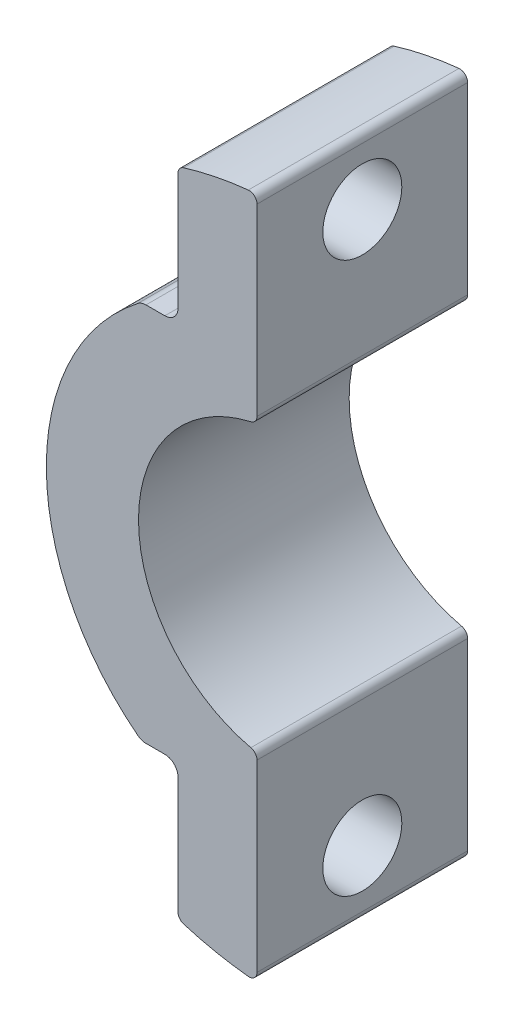
ISO-10303-21;
HEADER;
FILE_DESCRIPTION(('STEP AP214'),'2;1');
FILE_NAME('part.step','',(''),(''),'','','');
FILE_SCHEMA(('AUTOMOTIVE_DESIGN { 1 0 10303 214 1 1 1 1 }'));
ENDSEC;
DATA;
#1=APPLICATION_CONTEXT('core data for automotive mechanical design processes');
#2=APPLICATION_PROTOCOL_DEFINITION('international standard','automotive_design',2000,#1);
#3=PRODUCT_CONTEXT('',#1,'mechanical');
#4=PRODUCT('Part','Part','',(#3));
#5=PRODUCT_RELATED_PRODUCT_CATEGORY('part','',(#4));
#6=PRODUCT_DEFINITION_FORMATION('','',#4);
#7=PRODUCT_DEFINITION_CONTEXT('part definition',#1,'design');
#8=PRODUCT_DEFINITION('design','',#6,#7);
#9=PRODUCT_DEFINITION_SHAPE('','',#8);
#10=(LENGTH_UNIT() NAMED_UNIT(*) SI_UNIT(.MILLI.,.METRE.));
#11=(NAMED_UNIT(*) PLANE_ANGLE_UNIT() SI_UNIT($,.RADIAN.));
#12=(NAMED_UNIT(*) SI_UNIT($,.STERADIAN.) SOLID_ANGLE_UNIT());
#13=UNCERTAINTY_MEASURE_WITH_UNIT(LENGTH_MEASURE(1.E-05),#10,'distance_accuracy_value','');
#14=(GEOMETRIC_REPRESENTATION_CONTEXT(3) GLOBAL_UNCERTAINTY_ASSIGNED_CONTEXT((#13)) GLOBAL_UNIT_ASSIGNED_CONTEXT((#10,
#11,#12)) REPRESENTATION_CONTEXT('',''));
#15=CARTESIAN_POINT('',(0.,0.,0.));
#16=DIRECTION('',(0.,0.,1.));
#17=DIRECTION('',(1.,0.,0.));
#18=AXIS2_PLACEMENT_3D('',#15,#16,#17);
#19=CARTESIAN_POINT('',(0.,0.,8.));
#20=DIRECTION('',(0.,0.,1.));
#21=DIRECTION('',(1.,0.,0.));
#22=AXIS2_PLACEMENT_3D('',#19,#20,#21);
#23=PLANE('',#22);
#24=CARTESIAN_POINT('',(0.,0.,8.));
#25=DIRECTION('',(0.,0.,-1.));
#26=DIRECTION('',(1.,0.,0.));
#27=AXIS2_PLACEMENT_3D('',#24,#25,#26);
#28=CIRCLE('',#27,9.);
#29=CARTESIAN_POINT('',(-5.52275871873927,-7.10627442015782,8.));
#30=VERTEX_POINT('',#29);
#31=CARTESIAN_POINT('',(-5.52275871873927,7.10627442015782,8.));
#32=VERTEX_POINT('',#31);
#33=EDGE_CURVE('E319',#30,#32,#28,.T.);
#34=ORIENTED_EDGE('',*,*,#33,.F.);
#35=CARTESIAN_POINT('',(-5.21593878992042,-6.71148139681572,8.));
#36=DIRECTION('',(0.,0.,1.));
#37=DIRECTION('',(1.,0.,0.));
#38=AXIS2_PLACEMENT_3D('',#35,#36,#37);
#39=CIRCLE('',#38,0.5);
#40=CARTESIAN_POINT('',(-5.21593878992042,-7.21148139681572,8.));
#41=VERTEX_POINT('',#40);
#42=EDGE_CURVE('E43',#30,#41,#39,.T.);
#43=ORIENTED_EDGE('',*,*,#42,.T.);
#44=DIRECTION('',(-1.,0.,0.));
#45=VECTOR('',#44,1.);
#46=CARTESIAN_POINT('',(-4.,-7.21148139681572,8.));
#47=LINE('',#46,#45);
#48=CARTESIAN_POINT('',(-4.5,-7.21148139681572,8.));
#49=VERTEX_POINT('',#48);
#50=EDGE_CURVE('E190',#49,#41,#47,.T.);
#51=ORIENTED_EDGE('',*,*,#50,.F.);
#52=CARTESIAN_POINT('',(-4.5,-7.71148139681572,8.));
#53=DIRECTION('',(0.,0.,1.));
#54=DIRECTION('',(1.,0.,0.));
#55=AXIS2_PLACEMENT_3D('',#52,#53,#54);
#56=CIRCLE('',#55,0.5);
#57=CARTESIAN_POINT('',(-4.,-7.71148139681572,8.));
#58=VERTEX_POINT('',#57);
#59=EDGE_CURVE('E173',#49,#58,#56,.F.);
#60=ORIENTED_EDGE('',*,*,#59,.T.);
#61=DIRECTION('',(0.,1.,0.));
#62=VECTOR('',#61,1.);
#63=CARTESIAN_POINT('',(-4.,-7.21148139681572,8.));
#64=LINE('',#63,#62);
#65=CARTESIAN_POINT('',(-4.,-12.14907403879,8.));
#66=VERTEX_POINT('',#65);
#67=EDGE_CURVE('E198',#66,#58,#64,.T.);
#68=ORIENTED_EDGE('',*,*,#67,.F.);
#69=CARTESIAN_POINT('',(-3.7,-12.14907403879,8.));
#70=DIRECTION('',(0.,0.,1.));
#71=DIRECTION('',(1.,0.,0.));
#72=AXIS2_PLACEMENT_3D('',#69,#70,#71);
#73=CIRCLE('',#72,0.3);
#74=CARTESIAN_POINT('',(-3.78740157480315,-12.4360600397063,8.));
#75=VERTEX_POINT('',#74);
#76=EDGE_CURVE('E281',#66,#75,#73,.T.);
#77=ORIENTED_EDGE('',*,*,#76,.T.);
#78=CARTESIAN_POINT('',(0.,0.,8.));
#79=DIRECTION('',(0.,0.,1.));
#80=DIRECTION('',(1.,0.,0.));
#81=AXIS2_PLACEMENT_3D('',#78,#79,#80);
#82=CIRCLE('',#81,13.);
#83=CARTESIAN_POINT('',(-1.33070866141732,-12.9317135159432,8.));
#84=VERTEX_POINT('',#83);
#85=EDGE_CURVE('E229',#75,#84,#82,.T.);
#86=ORIENTED_EDGE('',*,*,#85,.T.);
#87=CARTESIAN_POINT('',(-1.3,-12.633289357883,8.));
#88=DIRECTION('',(0.,0.,1.));
#89=DIRECTION('',(1.,0.,0.));
#90=AXIS2_PLACEMENT_3D('',#87,#88,#89);
#91=CIRCLE('',#90,0.3);
#92=CARTESIAN_POINT('',(-1.,-12.633289357883,8.));
#93=VERTEX_POINT('',#92);
#94=EDGE_CURVE('E279',#84,#93,#91,.T.);
#95=ORIENTED_EDGE('',*,*,#94,.T.);
#96=DIRECTION('',(0.,-1.,0.));
#97=VECTOR('',#96,1.);
#98=CARTESIAN_POINT('',(-1.,24.2431667663396,8.));
#99=LINE('',#98,#97);
#100=CARTESIAN_POINT('',(-1.,-5.65243310442503,8.));
#101=VERTEX_POINT('',#100);
#102=EDGE_CURVE('E208',#101,#93,#99,.T.);
#103=ORIENTED_EDGE('',*,*,#102,.F.);
#104=CARTESIAN_POINT('',(-1.3,-5.65243310442503,8.));
#105=DIRECTION('',(0.,0.,1.));
#106=DIRECTION('',(1.,0.,0.));
#107=AXIS2_PLACEMENT_3D('',#104,#105,#106);
#108=CIRCLE('',#107,0.3);
#109=CARTESIAN_POINT('',(-1.23275862068966,-5.36006587488581,8.));
#110=VERTEX_POINT('',#109);
#111=EDGE_CURVE('E277',#101,#110,#108,.T.);
#112=ORIENTED_EDGE('',*,*,#111,.T.);
#113=CARTESIAN_POINT('',(0.,0.,8.));
#114=DIRECTION('',(0.,0.,1.));
#115=DIRECTION('',(1.,0.,0.));
#116=AXIS2_PLACEMENT_3D('',#113,#114,#115);
#117=CIRCLE('',#116,5.5);
#118=CARTESIAN_POINT('',(-1.23275862068966,5.36006587488581,8.));
#119=VERTEX_POINT('',#118);
#120=EDGE_CURVE('E220',#119,#110,#117,.T.);
#121=ORIENTED_EDGE('',*,*,#120,.F.);
#122=CARTESIAN_POINT('',(-1.3,5.65243310442503,8.));
#123=DIRECTION('',(0.,0.,1.));
#124=DIRECTION('',(1.,0.,0.));
#125=AXIS2_PLACEMENT_3D('',#122,#123,#124);
#126=CIRCLE('',#125,0.3);
#127=CARTESIAN_POINT('',(-1.,5.65243310442503,8.));
#128=VERTEX_POINT('',#127);
#129=EDGE_CURVE('E275',#119,#128,#126,.T.);
#130=ORIENTED_EDGE('',*,*,#129,.T.);
#131=CARTESIAN_POINT('',(-1.,12.633289357883,8.));
#132=VERTEX_POINT('',#131);
#133=EDGE_CURVE('E217',#132,#128,#99,.T.);
#134=ORIENTED_EDGE('',*,*,#133,.F.);
#135=CARTESIAN_POINT('',(-1.3,12.633289357883,8.));
#136=DIRECTION('',(0.,0.,1.));
#137=DIRECTION('',(1.,0.,0.));
#138=AXIS2_PLACEMENT_3D('',#135,#136,#137);
#139=CIRCLE('',#138,0.3);
#140=CARTESIAN_POINT('',(-1.33070866141732,12.9317135159432,8.));
#141=VERTEX_POINT('',#140);
#142=EDGE_CURVE('E271',#132,#141,#139,.T.);
#143=ORIENTED_EDGE('',*,*,#142,.T.);
#144=CARTESIAN_POINT('',(-3.78740157480315,12.4360600397063,8.));
#145=VERTEX_POINT('',#144);
#146=EDGE_CURVE('E194',#141,#145,#82,.T.);
#147=ORIENTED_EDGE('',*,*,#146,.T.);
#148=CARTESIAN_POINT('',(-3.7,12.14907403879,8.));
#149=DIRECTION('',(0.,0.,1.));
#150=DIRECTION('',(1.,0.,0.));
#151=AXIS2_PLACEMENT_3D('',#148,#149,#150);
#152=CIRCLE('',#151,0.3);
#153=CARTESIAN_POINT('',(-4.,12.14907403879,8.));
#154=VERTEX_POINT('',#153);
#155=EDGE_CURVE('E273',#145,#154,#152,.T.);
#156=ORIENTED_EDGE('',*,*,#155,.T.);
#157=DIRECTION('',(0.,1.,0.));
#158=VECTOR('',#157,1.);
#159=CARTESIAN_POINT('',(-4.,21.0444914195402,8.));
#160=LINE('',#159,#158);
#161=CARTESIAN_POINT('',(-4.,7.71148139681573,8.));
#162=VERTEX_POINT('',#161);
#163=EDGE_CURVE('E327',#162,#154,#160,.T.);
#164=ORIENTED_EDGE('',*,*,#163,.F.);
#165=CARTESIAN_POINT('',(-4.5,7.71148139681572,8.));
#166=DIRECTION('',(0.,0.,1.));
#167=DIRECTION('',(1.,0.,0.));
#168=AXIS2_PLACEMENT_3D('',#165,#166,#167);
#169=CIRCLE('',#168,0.5);
#170=CARTESIAN_POINT('',(-4.5,7.21148139681572,8.));
#171=VERTEX_POINT('',#170);
#172=EDGE_CURVE('E246',#162,#171,#169,.F.);
#173=ORIENTED_EDGE('',*,*,#172,.T.);
#174=DIRECTION('',(1.,0.,0.));
#175=VECTOR('',#174,1.);
#176=CARTESIAN_POINT('',(-28.8712300204423,7.21148139681572,8.));
#177=LINE('',#176,#175);
#178=CARTESIAN_POINT('',(-5.21593878992042,7.21148139681572,8.));
#179=VERTEX_POINT('',#178);
#180=EDGE_CURVE('E326',#179,#171,#177,.T.);
#181=ORIENTED_EDGE('',*,*,#180,.F.);
#182=CARTESIAN_POINT('',(-5.21593878992042,6.71148139681572,8.));
#183=DIRECTION('',(0.,0.,1.));
#184=DIRECTION('',(1.,0.,0.));
#185=AXIS2_PLACEMENT_3D('',#182,#183,#184);
#186=CIRCLE('',#185,0.5);
#187=EDGE_CURVE('E50',#179,#32,#186,.T.);
#188=ORIENTED_EDGE('',*,*,#187,.T.);
#189=EDGE_LOOP('',(#34,#43,#51,#60,#68,#77,#86,#95,#103,#112,#121,#130,#134,#143,#147,#156,#164,
#173,#181,#188));
#190=FACE_BOUND('',#189,.T.);
#191=ADVANCED_FACE('F35',(#190),#23,.T.);
#192=CARTESIAN_POINT('',(0.,0.,0.));
#193=DIRECTION('',(0.,0.,1.));
#194=DIRECTION('',(1.,0.,0.));
#195=AXIS2_PLACEMENT_3D('',#192,#193,#194);
#196=PLANE('',#195);
#197=DIRECTION('',(-1.,0.,0.));
#198=VECTOR('',#197,1.);
#199=CARTESIAN_POINT('',(-4.,-7.21148139681572,0.));
#200=LINE('',#199,#198);
#201=CARTESIAN_POINT('',(-4.5,-7.21148139681572,0.));
#202=VERTEX_POINT('',#201);
#203=CARTESIAN_POINT('',(-5.21593878992042,-7.21148139681572,0.));
#204=VERTEX_POINT('',#203);
#205=EDGE_CURVE('E193',#202,#204,#200,.T.);
#206=ORIENTED_EDGE('',*,*,#205,.T.);
#207=CARTESIAN_POINT('',(-5.21593878992042,-6.71148139681572,0.));
#208=DIRECTION('',(0.,0.,1.));
#209=DIRECTION('',(1.,0.,0.));
#210=AXIS2_PLACEMENT_3D('',#207,#208,#209);
#211=CIRCLE('',#210,0.5);
#212=CARTESIAN_POINT('',(-5.52275871873927,-7.10627442015782,0.));
#213=VERTEX_POINT('',#212);
#214=EDGE_CURVE('E309',#204,#213,#211,.F.);
#215=ORIENTED_EDGE('',*,*,#214,.T.);
#216=CARTESIAN_POINT('',(0.,0.,0.));
#217=DIRECTION('',(0.,0.,-1.));
#218=DIRECTION('',(1.,0.,0.));
#219=AXIS2_PLACEMENT_3D('',#216,#217,#218);
#220=CIRCLE('',#219,9.);
#221=CARTESIAN_POINT('',(-5.52275871873927,7.10627442015782,0.));
#222=VERTEX_POINT('',#221);
#223=EDGE_CURVE('E201',#213,#222,#220,.T.);
#224=ORIENTED_EDGE('',*,*,#223,.T.);
#225=CARTESIAN_POINT('',(-5.21593878992042,6.71148139681572,0.));
#226=DIRECTION('',(0.,0.,1.));
#227=DIRECTION('',(1.,0.,0.));
#228=AXIS2_PLACEMENT_3D('',#225,#226,#227);
#229=CIRCLE('',#228,0.5);
#230=CARTESIAN_POINT('',(-5.21593878992042,7.21148139681572,0.));
#231=VERTEX_POINT('',#230);
#232=EDGE_CURVE('E307',#222,#231,#229,.F.);
#233=ORIENTED_EDGE('',*,*,#232,.T.);
#234=DIRECTION('',(1.,0.,0.));
#235=VECTOR('',#234,1.);
#236=CARTESIAN_POINT('',(-28.8712300204423,7.21148139681572,0.));
#237=LINE('',#236,#235);
#238=CARTESIAN_POINT('',(-4.5,7.21148139681572,0.));
#239=VERTEX_POINT('',#238);
#240=EDGE_CURVE('E331',#231,#239,#237,.T.);
#241=ORIENTED_EDGE('',*,*,#240,.T.);
#242=CARTESIAN_POINT('',(-4.5,7.71148139681572,0.));
#243=DIRECTION('',(0.,0.,1.));
#244=DIRECTION('',(1.,0.,0.));
#245=AXIS2_PLACEMENT_3D('',#242,#243,#244);
#246=CIRCLE('',#245,0.5);
#247=CARTESIAN_POINT('',(-4.,7.71148139681573,0.));
#248=VERTEX_POINT('',#247);
#249=EDGE_CURVE('E249',#239,#248,#246,.T.);
#250=ORIENTED_EDGE('',*,*,#249,.T.);
#251=DIRECTION('',(0.,1.,0.));
#252=VECTOR('',#251,1.);
#253=CARTESIAN_POINT('',(-4.,21.0444914195402,0.));
#254=LINE('',#253,#252);
#255=CARTESIAN_POINT('',(-4.,12.14907403879,0.));
#256=VERTEX_POINT('',#255);
#257=EDGE_CURVE('E236',#248,#256,#254,.T.);
#258=ORIENTED_EDGE('',*,*,#257,.T.);
#259=CARTESIAN_POINT('',(-3.7,12.14907403879,0.));
#260=DIRECTION('',(0.,0.,1.));
#261=DIRECTION('',(1.,0.,0.));
#262=AXIS2_PLACEMENT_3D('',#259,#260,#261);
#263=CIRCLE('',#262,0.3);
#264=CARTESIAN_POINT('',(-3.78740157480315,12.4360600397063,0.));
#265=VERTEX_POINT('',#264);
#266=EDGE_CURVE('E259',#256,#265,#263,.F.);
#267=ORIENTED_EDGE('',*,*,#266,.T.);
#268=CARTESIAN_POINT('',(0.,0.,0.));
#269=DIRECTION('',(0.,0.,1.));
#270=DIRECTION('',(1.,0.,0.));
#271=AXIS2_PLACEMENT_3D('',#268,#269,#270);
#272=CIRCLE('',#271,13.);
#273=CARTESIAN_POINT('',(-1.33070866141732,12.9317135159432,0.));
#274=VERTEX_POINT('',#273);
#275=EDGE_CURVE('E230',#274,#265,#272,.T.);
#276=ORIENTED_EDGE('',*,*,#275,.F.);
#277=CARTESIAN_POINT('',(-1.3,12.633289357883,0.));
#278=DIRECTION('',(0.,0.,1.));
#279=DIRECTION('',(1.,0.,0.));
#280=AXIS2_PLACEMENT_3D('',#277,#278,#279);
#281=CIRCLE('',#280,0.3);
#282=CARTESIAN_POINT('',(-1.,12.633289357883,0.));
#283=VERTEX_POINT('',#282);
#284=EDGE_CURVE('E257',#274,#283,#281,.F.);
#285=ORIENTED_EDGE('',*,*,#284,.T.);
#286=DIRECTION('',(0.,-1.,0.));
#287=VECTOR('',#286,1.);
#288=CARTESIAN_POINT('',(-1.,24.2431667663396,0.));
#289=LINE('',#288,#287);
#290=CARTESIAN_POINT('',(-1.,5.65243310442503,0.));
#291=VERTEX_POINT('',#290);
#292=EDGE_CURVE('E216',#283,#291,#289,.T.);
#293=ORIENTED_EDGE('',*,*,#292,.T.);
#294=CARTESIAN_POINT('',(-1.3,5.65243310442503,0.));
#295=DIRECTION('',(0.,0.,1.));
#296=DIRECTION('',(1.,0.,0.));
#297=AXIS2_PLACEMENT_3D('',#294,#295,#296);
#298=CIRCLE('',#297,0.3);
#299=CARTESIAN_POINT('',(-1.23275862068966,5.36006587488581,0.));
#300=VERTEX_POINT('',#299);
#301=EDGE_CURVE('E261',#291,#300,#298,.F.);
#302=ORIENTED_EDGE('',*,*,#301,.T.);
#303=CARTESIAN_POINT('',(0.,0.,0.));
#304=DIRECTION('',(0.,0.,1.));
#305=DIRECTION('',(1.,0.,0.));
#306=AXIS2_PLACEMENT_3D('',#303,#304,#305);
#307=CIRCLE('',#306,5.5);
#308=CARTESIAN_POINT('',(-1.23275862068966,-5.36006587488581,0.));
#309=VERTEX_POINT('',#308);
#310=EDGE_CURVE('E224',#300,#309,#307,.T.);
#311=ORIENTED_EDGE('',*,*,#310,.T.);
#312=CARTESIAN_POINT('',(-1.3,-5.65243310442503,0.));
#313=DIRECTION('',(0.,0.,1.));
#314=DIRECTION('',(1.,0.,0.));
#315=AXIS2_PLACEMENT_3D('',#312,#313,#314);
#316=CIRCLE('',#315,0.3);
#317=CARTESIAN_POINT('',(-1.,-5.65243310442503,0.));
#318=VERTEX_POINT('',#317);
#319=EDGE_CURVE('E263',#309,#318,#316,.F.);
#320=ORIENTED_EDGE('',*,*,#319,.T.);
#321=CARTESIAN_POINT('',(-1.,-12.633289357883,0.));
#322=VERTEX_POINT('',#321);
#323=EDGE_CURVE('E213',#318,#322,#289,.T.);
#324=ORIENTED_EDGE('',*,*,#323,.T.);
#325=CARTESIAN_POINT('',(-1.3,-12.633289357883,0.));
#326=DIRECTION('',(0.,0.,1.));
#327=DIRECTION('',(1.,0.,0.));
#328=AXIS2_PLACEMENT_3D('',#325,#326,#327);
#329=CIRCLE('',#328,0.3);
#330=CARTESIAN_POINT('',(-1.33070866141732,-12.9317135159432,0.));
#331=VERTEX_POINT('',#330);
#332=EDGE_CURVE('E265',#322,#331,#329,.F.);
#333=ORIENTED_EDGE('',*,*,#332,.T.);
#334=CARTESIAN_POINT('',(-3.78740157480315,-12.4360600397063,0.));
#335=VERTEX_POINT('',#334);
#336=EDGE_CURVE('E223',#335,#331,#272,.T.);
#337=ORIENTED_EDGE('',*,*,#336,.F.);
#338=CARTESIAN_POINT('',(-3.7,-12.14907403879,0.));
#339=DIRECTION('',(0.,0.,1.));
#340=DIRECTION('',(1.,0.,0.));
#341=AXIS2_PLACEMENT_3D('',#338,#339,#340);
#342=CIRCLE('',#341,0.3);
#343=CARTESIAN_POINT('',(-4.,-12.14907403879,0.));
#344=VERTEX_POINT('',#343);
#345=EDGE_CURVE('E267',#335,#344,#342,.F.);
#346=ORIENTED_EDGE('',*,*,#345,.T.);
#347=DIRECTION('',(0.,1.,0.));
#348=VECTOR('',#347,1.);
#349=CARTESIAN_POINT('',(-4.,-7.21148139681572,0.));
#350=LINE('',#349,#348);
#351=CARTESIAN_POINT('',(-4.,-7.71148139681572,0.));
#352=VERTEX_POINT('',#351);
#353=EDGE_CURVE('E197',#344,#352,#350,.T.);
#354=ORIENTED_EDGE('',*,*,#353,.T.);
#355=CARTESIAN_POINT('',(-4.5,-7.71148139681572,0.));
#356=DIRECTION('',(0.,0.,1.));
#357=DIRECTION('',(1.,0.,0.));
#358=AXIS2_PLACEMENT_3D('',#355,#356,#357);
#359=CIRCLE('',#358,0.5);
#360=EDGE_CURVE('E182',#352,#202,#359,.T.);
#361=ORIENTED_EDGE('',*,*,#360,.T.);
#362=EDGE_LOOP('',(#206,#215,#224,#233,#241,#250,#258,#267,#276,#285,#293,#302,#311,#320,#324,
#333,#337,#346,#354,#361));
#363=FACE_BOUND('',#362,.T.);
#364=ADVANCED_FACE('F325',(#363),#196,.F.);
#365=CARTESIAN_POINT('',(0.,0.,8.));
#366=DIRECTION('',(0.,0.,-1.));
#367=DIRECTION('',(-1.,0.,0.));
#368=AXIS2_PLACEMENT_3D('',#365,#366,#367);
#369=CYLINDRICAL_SURFACE('',#368,13.);
#370=ORIENTED_EDGE('',*,*,#275,.T.);
#371=DIRECTION('',(0.,0.,-1.));
#372=VECTOR('',#371,1.);
#373=CARTESIAN_POINT('',(-3.78740157480315,12.4360600397063,8.));
#374=LINE('',#373,#372);
#375=EDGE_CURVE('E300',#265,#145,#374,.F.);
#376=ORIENTED_EDGE('',*,*,#375,.T.);
#377=ORIENTED_EDGE('',*,*,#146,.F.);
#378=DIRECTION('',(0.,0.,-1.));
#379=VECTOR('',#378,1.);
#380=CARTESIAN_POINT('',(-1.33070866141732,12.9317135159432,8.));
#381=LINE('',#380,#379);
#382=EDGE_CURVE('E297',#141,#274,#381,.T.);
#383=ORIENTED_EDGE('',*,*,#382,.T.);
#384=EDGE_LOOP('',(#370,#376,#377,#383));
#385=FACE_BOUND('',#384,.T.);
#386=ADVANCED_FACE('F356',(#385),#369,.T.);
#387=ORIENTED_EDGE('',*,*,#85,.F.);
#388=DIRECTION('',(0.,0.,-1.));
#389=VECTOR('',#388,1.);
#390=CARTESIAN_POINT('',(-3.78740157480315,-12.4360600397063,8.));
#391=LINE('',#390,#389);
#392=EDGE_CURVE('E254',#75,#335,#391,.T.);
#393=ORIENTED_EDGE('',*,*,#392,.T.);
#394=ORIENTED_EDGE('',*,*,#336,.T.);
#395=DIRECTION('',(0.,0.,-1.));
#396=VECTOR('',#395,1.);
#397=CARTESIAN_POINT('',(-1.33070866141732,-12.9317135159432,8.));
#398=LINE('',#397,#396);
#399=EDGE_CURVE('E251',#331,#84,#398,.F.);
#400=ORIENTED_EDGE('',*,*,#399,.T.);
#401=EDGE_LOOP('',(#387,#393,#394,#400));
#402=FACE_BOUND('',#401,.T.);
#403=ADVANCED_FACE('F396',(#402),#369,.T.);
#404=CARTESIAN_POINT('',(0.,0.,8.));
#405=DIRECTION('',(0.,0.,-1.));
#406=DIRECTION('',(-1.,0.,0.));
#407=AXIS2_PLACEMENT_3D('',#404,#405,#406);
#408=CYLINDRICAL_SURFACE('',#407,5.5);
#409=ORIENTED_EDGE('',*,*,#120,.T.);
#410=DIRECTION('',(0.,0.,-1.));
#411=VECTOR('',#410,1.);
#412=CARTESIAN_POINT('',(-1.23275862068966,-5.36006587488581,8.));
#413=LINE('',#412,#411);
#414=EDGE_CURVE('E290',#110,#309,#413,.T.);
#415=ORIENTED_EDGE('',*,*,#414,.T.);
#416=ORIENTED_EDGE('',*,*,#310,.F.);
#417=DIRECTION('',(0.,0.,-1.));
#418=VECTOR('',#417,1.);
#419=CARTESIAN_POINT('',(-1.23275862068966,5.36006587488581,8.));
#420=LINE('',#419,#418);
#421=EDGE_CURVE('E288',#300,#119,#420,.F.);
#422=ORIENTED_EDGE('',*,*,#421,.T.);
#423=EDGE_LOOP('',(#409,#415,#416,#422));
#424=FACE_BOUND('',#423,.T.);
#425=ADVANCED_FACE('F376',(#424),#408,.F.);
#426=CARTESIAN_POINT('',(-1.,24.2431667663396,0.));
#427=DIRECTION('',(-1.,0.,0.));
#428=DIRECTION('',(0.,-1.,0.));
#429=AXIS2_PLACEMENT_3D('',#426,#427,#428);
#430=PLANE('',#429);
#431=CARTESIAN_POINT('',(-1.,-10.4614813968157,4.));
#432=DIRECTION('',(1.,0.,0.));
#433=DIRECTION('',(0.,1.,0.));
#434=AXIS2_PLACEMENT_3D('',#431,#432,#433);
#435=CIRCLE('',#434,1.5);
#436=CARTESIAN_POINT('',(-1.,-8.96148139681572,4.));
#437=VERTEX_POINT('',#436);
#438=EDGE_CURVE('E209',#437,#437,#435,.T.);
#439=ORIENTED_EDGE('',*,*,#438,.F.);
#440=EDGE_LOOP('',(#439));
#441=FACE_BOUND('',#440,.T.);
#442=ORIENTED_EDGE('',*,*,#102,.T.);
#443=DIRECTION('',(0.,0.,-1.));
#444=VECTOR('',#443,1.);
#445=CARTESIAN_POINT('',(-1.,-12.633289357883,0.));
#446=LINE('',#445,#444);
#447=EDGE_CURVE('E286',#93,#322,#446,.T.);
#448=ORIENTED_EDGE('',*,*,#447,.T.);
#449=ORIENTED_EDGE('',*,*,#323,.F.);
#450=DIRECTION('',(0.,0.,1.));
#451=VECTOR('',#450,1.);
#452=CARTESIAN_POINT('',(-1.,-5.65243310442503,8.));
#453=LINE('',#452,#451);
#454=EDGE_CURVE('E283',#318,#101,#453,.T.);
#455=ORIENTED_EDGE('',*,*,#454,.T.);
#456=EDGE_LOOP('',(#442,#448,#449,#455));
#457=FACE_BOUND('',#456,.T.);
#458=ADVANCED_FACE('F386',(#441,#457),#430,.F.);
#459=CARTESIAN_POINT('',(-1.,10.4614813968157,4.));
#460=DIRECTION('',(1.,0.,0.));
#461=DIRECTION('',(0.,1.,0.));
#462=AXIS2_PLACEMENT_3D('',#459,#460,#461);
#463=CIRCLE('',#462,1.5);
#464=CARTESIAN_POINT('',(-1.,11.9614813968157,4.));
#465=VERTEX_POINT('',#464);
#466=EDGE_CURVE('E205',#465,#465,#463,.T.);
#467=ORIENTED_EDGE('',*,*,#466,.F.);
#468=EDGE_LOOP('',(#467));
#469=FACE_BOUND('',#468,.T.);
#470=ORIENTED_EDGE('',*,*,#133,.T.);
#471=DIRECTION('',(0.,0.,1.));
#472=VECTOR('',#471,1.);
#473=CARTESIAN_POINT('',(-1.,5.65243310442503,0.));
#474=LINE('',#473,#472);
#475=EDGE_CURVE('E294',#128,#291,#474,.F.);
#476=ORIENTED_EDGE('',*,*,#475,.T.);
#477=ORIENTED_EDGE('',*,*,#292,.F.);
#478=DIRECTION('',(0.,0.,-1.));
#479=VECTOR('',#478,1.);
#480=CARTESIAN_POINT('',(-1.,12.633289357883,0.));
#481=LINE('',#480,#479);
#482=EDGE_CURVE('E292',#283,#132,#481,.F.);
#483=ORIENTED_EDGE('',*,*,#482,.T.);
#484=EDGE_LOOP('',(#470,#476,#477,#483));
#485=FACE_BOUND('',#484,.T.);
#486=ADVANCED_FACE('F366',(#469,#485),#430,.F.);
#487=CARTESIAN_POINT('',(-9.,10.4614813968157,4.));
#488=DIRECTION('',(1.,0.,0.));
#489=DIRECTION('',(0.,1.,0.));
#490=AXIS2_PLACEMENT_3D('',#487,#488,#489);
#491=CYLINDRICAL_SURFACE('',#490,1.5);
#492=CARTESIAN_POINT('',(-4.,10.4614813968157,4.));
#493=DIRECTION('',(1.,0.,0.));
#494=DIRECTION('',(0.,0.,-1.));
#495=AXIS2_PLACEMENT_3D('',#492,#493,#494);
#496=CIRCLE('',#495,1.5);
#497=CARTESIAN_POINT('',(-4.,10.4614813968157,2.5));
#498=VERTEX_POINT('',#497);
#499=EDGE_CURVE('E212',#498,#498,#496,.F.);
#500=ORIENTED_EDGE('',*,*,#499,.T.);
#501=EDGE_LOOP('',(#500));
#502=FACE_BOUND('',#501,.T.);
#503=ORIENTED_EDGE('',*,*,#466,.T.);
#504=EDGE_LOOP('',(#503));
#505=FACE_BOUND('',#504,.T.);
#506=ADVANCED_FACE('F546',(#502,#505),#491,.F.);
#507=CARTESIAN_POINT('',(-9.,-10.4614813968157,4.));
#508=DIRECTION('',(1.,0.,0.));
#509=DIRECTION('',(0.,1.,0.));
#510=AXIS2_PLACEMENT_3D('',#507,#508,#509);
#511=CYLINDRICAL_SURFACE('',#510,1.5);
#512=CARTESIAN_POINT('',(-4.,-10.4614813968157,4.));
#513=DIRECTION('',(1.,0.,0.));
#514=DIRECTION('',(0.,1.,0.));
#515=AXIS2_PLACEMENT_3D('',#512,#513,#514);
#516=CIRCLE('',#515,1.5);
#517=CARTESIAN_POINT('',(-4.,-8.96148139681572,4.));
#518=VERTEX_POINT('',#517);
#519=EDGE_CURVE('E233',#518,#518,#516,.F.);
#520=ORIENTED_EDGE('',*,*,#519,.T.);
#521=EDGE_LOOP('',(#520));
#522=FACE_BOUND('',#521,.T.);
#523=ORIENTED_EDGE('',*,*,#438,.T.);
#524=EDGE_LOOP('',(#523));
#525=FACE_BOUND('',#524,.T.);
#526=ADVANCED_FACE('F414',(#522,#525),#511,.F.);
#527=CARTESIAN_POINT('',(-4.,-7.21148139681572,0.));
#528=DIRECTION('',(0.,1.,0.));
#529=DIRECTION('',(-1.,0.,0.));
#530=AXIS2_PLACEMENT_3D('',#527,#528,#529);
#531=PLANE('',#530);
#532=ORIENTED_EDGE('',*,*,#50,.T.);
#533=DIRECTION('',(0.,0.,1.));
#534=VECTOR('',#533,1.);
#535=CARTESIAN_POINT('',(-5.21593878992042,-7.21148139681572,0.));
#536=LINE('',#535,#534);
#537=EDGE_CURVE('E305',#41,#204,#536,.F.);
#538=ORIENTED_EDGE('',*,*,#537,.T.);
#539=ORIENTED_EDGE('',*,*,#205,.F.);
#540=DIRECTION('',(0.,0.,1.));
#541=VECTOR('',#540,1.);
#542=CARTESIAN_POINT('',(-4.5,-7.21148139681572,8.));
#543=LINE('',#542,#541);
#544=EDGE_CURVE('E177',#202,#49,#543,.T.);
#545=ORIENTED_EDGE('',*,*,#544,.T.);
#546=EDGE_LOOP('',(#532,#538,#539,#545));
#547=FACE_BOUND('',#546,.T.);
#548=ADVANCED_FACE('F188',(#547),#531,.F.);
#549=CARTESIAN_POINT('',(-4.,-7.21148139681572,0.));
#550=DIRECTION('',(1.,0.,0.));
#551=DIRECTION('',(0.,1.,0.));
#552=AXIS2_PLACEMENT_3D('',#549,#550,#551);
#553=PLANE('',#552);
#554=ORIENTED_EDGE('',*,*,#519,.F.);
#555=EDGE_LOOP('',(#554));
#556=FACE_BOUND('',#555,.T.);
#557=ORIENTED_EDGE('',*,*,#353,.F.);
#558=DIRECTION('',(0.,0.,-1.));
#559=VECTOR('',#558,1.);
#560=CARTESIAN_POINT('',(-4.,-12.14907403879,0.));
#561=LINE('',#560,#559);
#562=EDGE_CURVE('E269',#344,#66,#561,.F.);
#563=ORIENTED_EDGE('',*,*,#562,.T.);
#564=ORIENTED_EDGE('',*,*,#67,.T.);
#565=DIRECTION('',(0.,0.,1.));
#566=VECTOR('',#565,1.);
#567=CARTESIAN_POINT('',(-4.,-7.71148139681572,0.));
#568=LINE('',#567,#566);
#569=EDGE_CURVE('E179',#58,#352,#568,.F.);
#570=ORIENTED_EDGE('',*,*,#569,.T.);
#571=EDGE_LOOP('',(#557,#563,#564,#570));
#572=FACE_BOUND('',#571,.T.);
#573=ADVANCED_FACE('F405',(#556,#572),#553,.F.);
#574=CARTESIAN_POINT('',(-28.8712300204423,7.21148139681572,0.));
#575=DIRECTION('',(0.,-1.,0.));
#576=DIRECTION('',(0.,0.,-1.));
#577=AXIS2_PLACEMENT_3D('',#574,#575,#576);
#578=PLANE('',#577);
#579=ORIENTED_EDGE('',*,*,#240,.F.);
#580=DIRECTION('',(0.,0.,1.));
#581=VECTOR('',#580,1.);
#582=CARTESIAN_POINT('',(-5.21593878992042,7.21148139681572,0.));
#583=LINE('',#582,#581);
#584=EDGE_CURVE('E11',#231,#179,#583,.T.);
#585=ORIENTED_EDGE('',*,*,#584,.T.);
#586=ORIENTED_EDGE('',*,*,#180,.T.);
#587=DIRECTION('',(0.,0.,1.));
#588=VECTOR('',#587,1.);
#589=CARTESIAN_POINT('',(-4.5,7.21148139681572,0.));
#590=LINE('',#589,#588);
#591=EDGE_CURVE('E183',#171,#239,#590,.F.);
#592=ORIENTED_EDGE('',*,*,#591,.T.);
#593=EDGE_LOOP('',(#579,#585,#586,#592));
#594=FACE_BOUND('',#593,.T.);
#595=ADVANCED_FACE('F339',(#594),#578,.F.);
#596=CARTESIAN_POINT('',(-4.,21.0444914195402,0.));
#597=DIRECTION('',(1.,0.,0.));
#598=DIRECTION('',(0.,0.,-1.));
#599=AXIS2_PLACEMENT_3D('',#596,#597,#598);
#600=PLANE('',#599);
#601=ORIENTED_EDGE('',*,*,#499,.F.);
#602=EDGE_LOOP('',(#601));
#603=FACE_BOUND('',#602,.T.);
#604=ORIENTED_EDGE('',*,*,#163,.T.);
#605=DIRECTION('',(0.,0.,-1.));
#606=VECTOR('',#605,1.);
#607=CARTESIAN_POINT('',(-4.,12.14907403879,0.));
#608=LINE('',#607,#606);
#609=EDGE_CURVE('E303',#154,#256,#608,.T.);
#610=ORIENTED_EDGE('',*,*,#609,.T.);
#611=ORIENTED_EDGE('',*,*,#257,.F.);
#612=DIRECTION('',(0.,0.,1.));
#613=VECTOR('',#612,1.);
#614=CARTESIAN_POINT('',(-4.,7.71148139681572,8.));
#615=LINE('',#614,#613);
#616=EDGE_CURVE('E240',#248,#162,#615,.T.);
#617=ORIENTED_EDGE('',*,*,#616,.T.);
#618=EDGE_LOOP('',(#604,#610,#611,#617));
#619=FACE_BOUND('',#618,.T.);
#620=ADVANCED_FACE('F349',(#603,#619),#600,.F.);
#621=CARTESIAN_POINT('',(0.,0.,0.));
#622=DIRECTION('',(0.,0.,1.));
#623=DIRECTION('',(1.,0.,0.));
#624=AXIS2_PLACEMENT_3D('',#621,#622,#623);
#625=CYLINDRICAL_SURFACE('',#624,9.);
#626=ORIENTED_EDGE('',*,*,#223,.F.);
#627=DIRECTION('',(0.,0.,1.));
#628=VECTOR('',#627,1.);
#629=CARTESIAN_POINT('',(-5.52275871873927,-7.10627442015782,0.));
#630=LINE('',#629,#628);
#631=EDGE_CURVE('E313',#213,#30,#630,.T.);
#632=ORIENTED_EDGE('',*,*,#631,.T.);
#633=ORIENTED_EDGE('',*,*,#33,.T.);
#634=DIRECTION('',(0.,0.,1.));
#635=VECTOR('',#634,1.);
#636=CARTESIAN_POINT('',(-5.52275871873927,7.10627442015782,0.));
#637=LINE('',#636,#635);
#638=EDGE_CURVE('E311',#32,#222,#637,.F.);
#639=ORIENTED_EDGE('',*,*,#638,.T.);
#640=EDGE_LOOP('',(#626,#632,#633,#639));
#641=FACE_BOUND('',#640,.T.);
#642=ADVANCED_FACE('F318',(#641),#625,.T.);
#643=CARTESIAN_POINT('',(-4.5,-7.71148139681572,0.));
#644=DIRECTION('',(0.,0.,-1.));
#645=DIRECTION('',(-1.,0.,0.));
#646=AXIS2_PLACEMENT_3D('',#643,#644,#645);
#647=CYLINDRICAL_SURFACE('',#646,0.5);
#648=ORIENTED_EDGE('',*,*,#360,.F.);
#649=ORIENTED_EDGE('',*,*,#569,.F.);
#650=ORIENTED_EDGE('',*,*,#59,.F.);
#651=ORIENTED_EDGE('',*,*,#544,.F.);
#652=EDGE_LOOP('',(#648,#649,#650,#651));
#653=FACE_BOUND('',#652,.T.);
#654=ADVANCED_FACE('F176',(#653),#647,.F.);
#655=CARTESIAN_POINT('',(-4.5,7.71148139681572,0.));
#656=DIRECTION('',(0.,0.,-1.));
#657=DIRECTION('',(-1.,0.,0.));
#658=AXIS2_PLACEMENT_3D('',#655,#656,#657);
#659=CYLINDRICAL_SURFACE('',#658,0.5);
#660=ORIENTED_EDGE('',*,*,#249,.F.);
#661=ORIENTED_EDGE('',*,*,#591,.F.);
#662=ORIENTED_EDGE('',*,*,#172,.F.);
#663=ORIENTED_EDGE('',*,*,#616,.F.);
#664=EDGE_LOOP('',(#660,#661,#662,#663));
#665=FACE_BOUND('',#664,.T.);
#666=ADVANCED_FACE('F345',(#665),#659,.F.);
#667=CARTESIAN_POINT('',(-3.7,-12.14907403879,8.));
#668=DIRECTION('',(0.,0.,-1.));
#669=DIRECTION('',(-1.,0.,0.));
#670=AXIS2_PLACEMENT_3D('',#667,#668,#669);
#671=CYLINDRICAL_SURFACE('',#670,0.3);
#672=ORIENTED_EDGE('',*,*,#76,.F.);
#673=ORIENTED_EDGE('',*,*,#562,.F.);
#674=ORIENTED_EDGE('',*,*,#345,.F.);
#675=ORIENTED_EDGE('',*,*,#392,.F.);
#676=EDGE_LOOP('',(#672,#673,#674,#675));
#677=FACE_BOUND('',#676,.T.);
#678=ADVANCED_FACE('F401',(#677),#671,.T.);
#679=CARTESIAN_POINT('',(-1.3,-12.633289357883,8.));
#680=DIRECTION('',(0.,0.,-1.));
#681=DIRECTION('',(-1.,0.,0.));
#682=AXIS2_PLACEMENT_3D('',#679,#680,#681);
#683=CYLINDRICAL_SURFACE('',#682,0.3);
#684=ORIENTED_EDGE('',*,*,#332,.F.);
#685=ORIENTED_EDGE('',*,*,#447,.F.);
#686=ORIENTED_EDGE('',*,*,#94,.F.);
#687=ORIENTED_EDGE('',*,*,#399,.F.);
#688=EDGE_LOOP('',(#684,#685,#686,#687));
#689=FACE_BOUND('',#688,.T.);
#690=ADVANCED_FACE('F390',(#689),#683,.T.);
#691=CARTESIAN_POINT('',(-1.3,-5.65243310442503,8.));
#692=DIRECTION('',(0.,0.,-1.));
#693=DIRECTION('',(-1.,0.,0.));
#694=AXIS2_PLACEMENT_3D('',#691,#692,#693);
#695=CYLINDRICAL_SURFACE('',#694,0.3);
#696=ORIENTED_EDGE('',*,*,#319,.F.);
#697=ORIENTED_EDGE('',*,*,#414,.F.);
#698=ORIENTED_EDGE('',*,*,#111,.F.);
#699=ORIENTED_EDGE('',*,*,#454,.F.);
#700=EDGE_LOOP('',(#696,#697,#698,#699));
#701=FACE_BOUND('',#700,.T.);
#702=ADVANCED_FACE('F380',(#701),#695,.T.);
#703=CARTESIAN_POINT('',(-1.3,5.65243310442503,8.));
#704=DIRECTION('',(0.,0.,-1.));
#705=DIRECTION('',(-1.,0.,0.));
#706=AXIS2_PLACEMENT_3D('',#703,#704,#705);
#707=CYLINDRICAL_SURFACE('',#706,0.3);
#708=ORIENTED_EDGE('',*,*,#129,.F.);
#709=ORIENTED_EDGE('',*,*,#421,.F.);
#710=ORIENTED_EDGE('',*,*,#301,.F.);
#711=ORIENTED_EDGE('',*,*,#475,.F.);
#712=EDGE_LOOP('',(#708,#709,#710,#711));
#713=FACE_BOUND('',#712,.T.);
#714=ADVANCED_FACE('F371',(#713),#707,.T.);
#715=CARTESIAN_POINT('',(-3.7,12.14907403879,8.));
#716=DIRECTION('',(0.,0.,-1.));
#717=DIRECTION('',(-1.,0.,0.));
#718=AXIS2_PLACEMENT_3D('',#715,#716,#717);
#719=CYLINDRICAL_SURFACE('',#718,0.3);
#720=ORIENTED_EDGE('',*,*,#266,.F.);
#721=ORIENTED_EDGE('',*,*,#609,.F.);
#722=ORIENTED_EDGE('',*,*,#155,.F.);
#723=ORIENTED_EDGE('',*,*,#375,.F.);
#724=EDGE_LOOP('',(#720,#721,#722,#723));
#725=FACE_BOUND('',#724,.T.);
#726=ADVANCED_FACE('F352',(#725),#719,.T.);
#727=CARTESIAN_POINT('',(-1.3,12.633289357883,8.));
#728=DIRECTION('',(0.,0.,-1.));
#729=DIRECTION('',(-1.,0.,0.));
#730=AXIS2_PLACEMENT_3D('',#727,#728,#729);
#731=CYLINDRICAL_SURFACE('',#730,0.3);
#732=ORIENTED_EDGE('',*,*,#142,.F.);
#733=ORIENTED_EDGE('',*,*,#482,.F.);
#734=ORIENTED_EDGE('',*,*,#284,.F.);
#735=ORIENTED_EDGE('',*,*,#382,.F.);
#736=EDGE_LOOP('',(#732,#733,#734,#735));
#737=FACE_BOUND('',#736,.T.);
#738=ADVANCED_FACE('F361',(#737),#731,.T.);
#739=CARTESIAN_POINT('',(-5.21593878992042,-6.71148139681572,0.));
#740=DIRECTION('',(0.,0.,1.));
#741=DIRECTION('',(1.,0.,0.));
#742=AXIS2_PLACEMENT_3D('',#739,#740,#741);
#743=CYLINDRICAL_SURFACE('',#742,0.5);
#744=ORIENTED_EDGE('',*,*,#42,.F.);
#745=ORIENTED_EDGE('',*,*,#631,.F.);
#746=ORIENTED_EDGE('',*,*,#214,.F.);
#747=ORIENTED_EDGE('',*,*,#537,.F.);
#748=EDGE_LOOP('',(#744,#745,#746,#747));
#749=FACE_BOUND('',#748,.T.);
#750=ADVANCED_FACE('F323',(#749),#743,.T.);
#751=CARTESIAN_POINT('',(-5.21593878992042,6.71148139681572,0.));
#752=DIRECTION('',(0.,0.,1.));
#753=DIRECTION('',(1.,0.,0.));
#754=AXIS2_PLACEMENT_3D('',#751,#752,#753);
#755=CYLINDRICAL_SURFACE('',#754,0.5);
#756=ORIENTED_EDGE('',*,*,#232,.F.);
#757=ORIENTED_EDGE('',*,*,#638,.F.);
#758=ORIENTED_EDGE('',*,*,#187,.F.);
#759=ORIENTED_EDGE('',*,*,#584,.F.);
#760=EDGE_LOOP('',(#756,#757,#758,#759));
#761=FACE_BOUND('',#760,.T.);
#762=ADVANCED_FACE('F37',(#761),#755,.T.);
#763=CLOSED_SHELL('',(#191,#364,#386,#403,#425,#458,#486,#506,#526,#548,#573,#595,#620,#642,
#654,#666,#678,#690,#702,#714,#726,#738,#750,#762));
#764=MANIFOLD_SOLID_BREP('B2',#763);
#765=ADVANCED_BREP_SHAPE_REPRESENTATION('',(#18,#764),#14);
#766=SHAPE_DEFINITION_REPRESENTATION(#9,#765);
ENDSEC;
END-ISO-10303-21;
